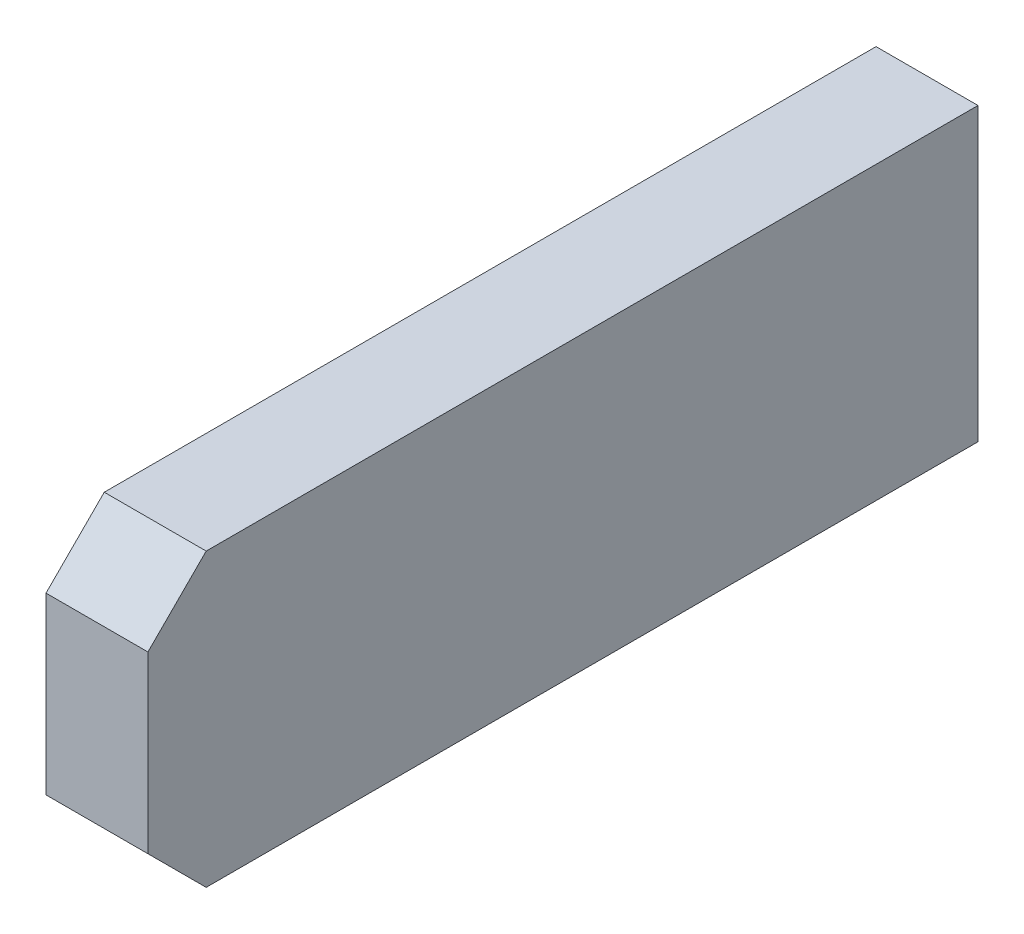
ISO-10303-21;
HEADER;
FILE_DESCRIPTION(('STEP AP214'),'2;1');
FILE_NAME('part.step','',(''),(''),'','','');
FILE_SCHEMA(('AUTOMOTIVE_DESIGN { 1 0 10303 214 1 1 1 1 }'));
ENDSEC;
DATA;
#1=APPLICATION_CONTEXT('core data for automotive mechanical design processes');
#2=APPLICATION_PROTOCOL_DEFINITION('international standard','automotive_design',2000,#1);
#3=PRODUCT_CONTEXT('',#1,'mechanical');
#4=PRODUCT('Part','Part','',(#3));
#5=PRODUCT_RELATED_PRODUCT_CATEGORY('part','',(#4));
#6=PRODUCT_DEFINITION_FORMATION('','',#4);
#7=PRODUCT_DEFINITION_CONTEXT('part definition',#1,'design');
#8=PRODUCT_DEFINITION('design','',#6,#7);
#9=PRODUCT_DEFINITION_SHAPE('','',#8);
#10=(LENGTH_UNIT() NAMED_UNIT(*) SI_UNIT(.MILLI.,.METRE.));
#11=(NAMED_UNIT(*) PLANE_ANGLE_UNIT() SI_UNIT($,.RADIAN.));
#12=(NAMED_UNIT(*) SI_UNIT($,.STERADIAN.) SOLID_ANGLE_UNIT());
#13=UNCERTAINTY_MEASURE_WITH_UNIT(LENGTH_MEASURE(1.E-05),#10,'distance_accuracy_value','');
#14=(GEOMETRIC_REPRESENTATION_CONTEXT(3) GLOBAL_UNCERTAINTY_ASSIGNED_CONTEXT((#13)) GLOBAL_UNIT_ASSIGNED_CONTEXT((#10,
#11,#12)) REPRESENTATION_CONTEXT('',''));
#15=CARTESIAN_POINT('',(0.,0.,0.));
#16=DIRECTION('',(0.,0.,1.));
#17=DIRECTION('',(1.,0.,0.));
#18=AXIS2_PLACEMENT_3D('',#15,#16,#17);
#19=CARTESIAN_POINT('',(58.82457889831,-9.921262189784,4.079481005067));
#20=DIRECTION('',(1.,0.,0.));
#21=DIRECTION('',(0.,0.,-1.));
#22=AXIS2_PLACEMENT_3D('',#19,#20,#21);
#23=PLANE('',#22);
#24=DIRECTION('',(0.,-0.707106781186548,-0.707106781186547));
#25=VECTOR('',#24,1.);
#26=CARTESIAN_POINT('',(58.82457889831,-10.72126218978,3.020000000046));
#27=LINE('',#26,#25);
#28=CARTESIAN_POINT('',(58.82457889831,-10.72126218978,3.020000000046));
#29=VERTEX_POINT('',#28);
#30=CARTESIAN_POINT('',(58.82457889831,-10.92126218978,2.820000000046));
#31=VERTEX_POINT('',#30);
#32=EDGE_CURVE('E85',#29,#31,#27,.T.);
#33=ORIENTED_EDGE('',*,*,#32,.T.);
#34=DIRECTION('',(0.,0.,-1.));
#35=VECTOR('',#34,1.);
#36=CARTESIAN_POINT('',(58.82457889831,-10.92126218978,4.079481005067));
#37=LINE('',#36,#35);
#38=CARTESIAN_POINT('',(58.82457889831,-10.92126218978,0.1700000000458));
#39=VERTEX_POINT('',#38);
#40=EDGE_CURVE('E86',#39,#31,#37,.F.);
#41=ORIENTED_EDGE('',*,*,#40,.F.);
#42=DIRECTION('',(0.,1.,0.));
#43=VECTOR('',#42,1.);
#44=CARTESIAN_POINT('',(58.82457889831,-10.92126218978,0.1700000000458));
#45=LINE('',#44,#43);
#46=CARTESIAN_POINT('',(58.82457889831,-9.921262189784,0.1700000000458));
#47=VERTEX_POINT('',#46);
#48=EDGE_CURVE('E94',#39,#47,#45,.T.);
#49=ORIENTED_EDGE('',*,*,#48,.T.);
#50=DIRECTION('',(0.,0.,1.));
#51=VECTOR('',#50,1.);
#52=CARTESIAN_POINT('',(58.82457889831,-9.921262189784,4.079481005067));
#53=LINE('',#52,#51);
#54=CARTESIAN_POINT('',(58.82457889831,-9.9212621897835,2.8200000000465));
#55=VERTEX_POINT('',#54);
#56=EDGE_CURVE('E71',#55,#47,#53,.F.);
#57=ORIENTED_EDGE('',*,*,#56,.F.);
#58=DIRECTION('',(0.,-0.707106781179474,0.707106781193621));
#59=VECTOR('',#58,1.);
#60=CARTESIAN_POINT('',(58.82457889831,-9.921262189784,2.820000000046));
#61=LINE('',#60,#59);
#62=CARTESIAN_POINT('',(58.82457889831,-10.12126218978,3.020000000046));
#63=VERTEX_POINT('',#62);
#64=EDGE_CURVE('E20',#55,#63,#61,.T.);
#65=ORIENTED_EDGE('',*,*,#64,.T.);
#66=DIRECTION('',(0.,1.,0.));
#67=VECTOR('',#66,1.);
#68=CARTESIAN_POINT('',(58.82457889831,-9.921262189784,3.020000000046));
#69=LINE('',#68,#67);
#70=EDGE_CURVE('E67',#63,#29,#69,.F.);
#71=ORIENTED_EDGE('',*,*,#70,.T.);
#72=EDGE_LOOP('',(#33,#41,#49,#57,#65,#71));
#73=FACE_BOUND('',#72,.T.);
#74=ADVANCED_FACE('F17',(#73),#23,.T.);
#75=CARTESIAN_POINT('',(58.47457889831,-10.92126218978,4.079481005067));
#76=DIRECTION('',(0.,-1.,0.));
#77=DIRECTION('',(0.,0.,-1.));
#78=AXIS2_PLACEMENT_3D('',#75,#76,#77);
#79=PLANE('',#78);
#80=DIRECTION('',(1.,0.,0.));
#81=VECTOR('',#80,1.);
#82=CARTESIAN_POINT('',(58.47457889831,-10.92126218978,2.820000000046));
#83=LINE('',#82,#81);
#84=CARTESIAN_POINT('',(58.47457889831,-10.92126218978,2.820000000046));
#85=VERTEX_POINT('',#84);
#86=EDGE_CURVE('E101',#85,#31,#83,.T.);
#87=ORIENTED_EDGE('',*,*,#86,.F.);
#88=DIRECTION('',(0.,0.,-1.));
#89=VECTOR('',#88,1.);
#90=CARTESIAN_POINT('',(58.47457889831,-10.92126218978,0.));
#91=LINE('',#90,#89);
#92=CARTESIAN_POINT('',(58.47457889831,-10.92126218978,0.1700000000458));
#93=VERTEX_POINT('',#92);
#94=EDGE_CURVE('E104',#85,#93,#91,.T.);
#95=ORIENTED_EDGE('',*,*,#94,.T.);
#96=DIRECTION('',(1.,0.,0.));
#97=VECTOR('',#96,1.);
#98=CARTESIAN_POINT('',(58.04457889831,-10.92126218978,0.1700000000458));
#99=LINE('',#98,#97);
#100=EDGE_CURVE('E91',#93,#39,#99,.T.);
#101=ORIENTED_EDGE('',*,*,#100,.T.);
#102=ORIENTED_EDGE('',*,*,#40,.T.);
#103=EDGE_LOOP('',(#87,#95,#101,#102));
#104=FACE_BOUND('',#103,.T.);
#105=ADVANCED_FACE('F121',(#104),#79,.T.);
#106=CARTESIAN_POINT('',(58.04457889831,-10.92126218978,0.1700000000458));
#107=DIRECTION('',(0.,0.,1.));
#108=DIRECTION('',(1.,0.,0.));
#109=AXIS2_PLACEMENT_3D('',#106,#107,#108);
#110=PLANE('',#109);
#111=ORIENTED_EDGE('',*,*,#100,.F.);
#112=DIRECTION('',(0.,1.,0.));
#113=VECTOR('',#112,1.);
#114=CARTESIAN_POINT('',(58.47457889831,0.,0.1700000000458));
#115=LINE('',#114,#113);
#116=CARTESIAN_POINT('',(58.47457889831,-9.921262189784,0.1700000000458));
#117=VERTEX_POINT('',#116);
#118=EDGE_CURVE('E107',#93,#117,#115,.T.);
#119=ORIENTED_EDGE('',*,*,#118,.T.);
#120=DIRECTION('',(1.,0.,0.));
#121=VECTOR('',#120,1.);
#122=CARTESIAN_POINT('',(58.47457889831,-9.921262189784,0.1700000000458));
#123=LINE('',#122,#121);
#124=EDGE_CURVE('E96',#47,#117,#123,.F.);
#125=ORIENTED_EDGE('',*,*,#124,.F.);
#126=ORIENTED_EDGE('',*,*,#48,.F.);
#127=EDGE_LOOP('',(#111,#119,#125,#126));
#128=FACE_BOUND('',#127,.T.);
#129=ADVANCED_FACE('F125',(#128),#110,.F.);
#130=CARTESIAN_POINT('',(58.47457889831,-9.921262189784,4.079481005067));
#131=DIRECTION('',(0.,1.,0.));
#132=DIRECTION('',(0.,0.,1.));
#133=AXIS2_PLACEMENT_3D('',#130,#131,#132);
#134=PLANE('',#133);
#135=DIRECTION('',(1.,0.,0.));
#136=VECTOR('',#135,1.);
#137=CARTESIAN_POINT('',(58.47457889831,-9.921262189782,2.820000000048));
#138=LINE('',#137,#136);
#139=CARTESIAN_POINT('',(58.47457889831,-9.9212621897835,2.8200000000465));
#140=VERTEX_POINT('',#139);
#141=EDGE_CURVE('E82',#55,#140,#138,.F.);
#142=ORIENTED_EDGE('',*,*,#141,.F.);
#143=ORIENTED_EDGE('',*,*,#56,.T.);
#144=ORIENTED_EDGE('',*,*,#124,.T.);
#145=DIRECTION('',(0.,0.,-1.));
#146=VECTOR('',#145,1.);
#147=CARTESIAN_POINT('',(58.47457889831,-9.921262189784,0.));
#148=LINE('',#147,#146);
#149=EDGE_CURVE('E110',#117,#140,#148,.F.);
#150=ORIENTED_EDGE('',*,*,#149,.T.);
#151=EDGE_LOOP('',(#142,#143,#144,#150));
#152=FACE_BOUND('',#151,.T.);
#153=ADVANCED_FACE('F127',(#152),#134,.T.);
#154=CARTESIAN_POINT('',(58.47457889831,-10.12126218978,3.020000000046));
#155=DIRECTION('',(0.,0.707106781186548,0.707106781186548));
#156=DIRECTION('',(0.,-0.707106781186548,0.707106781186548));
#157=AXIS2_PLACEMENT_3D('',#154,#155,#156);
#158=PLANE('',#157);
#159=ORIENTED_EDGE('',*,*,#141,.T.);
#160=DIRECTION('',(0.,-0.707106781179474,0.707106781193621));
#161=VECTOR('',#160,1.);
#162=CARTESIAN_POINT('',(58.47457889831,-9.921262189784,2.820000000046));
#163=LINE('',#162,#161);
#164=CARTESIAN_POINT('',(58.47457889831,-10.12126218978,3.020000000046));
#165=VERTEX_POINT('',#164);
#166=EDGE_CURVE('E78',#140,#165,#163,.T.);
#167=ORIENTED_EDGE('',*,*,#166,.T.);
#168=DIRECTION('',(-1.,0.,0.));
#169=VECTOR('',#168,1.);
#170=CARTESIAN_POINT('',(58.47457889831,-10.12126218978,3.020000000046));
#171=LINE('',#170,#169);
#172=EDGE_CURVE('E75',#165,#63,#171,.F.);
#173=ORIENTED_EDGE('',*,*,#172,.T.);
#174=ORIENTED_EDGE('',*,*,#64,.F.);
#175=EDGE_LOOP('',(#159,#167,#173,#174));
#176=FACE_BOUND('',#175,.T.);
#177=ADVANCED_FACE('F76',(#176),#158,.T.);
#178=CARTESIAN_POINT('',(58.47457889831,-9.871262189784,3.020000000046));
#179=DIRECTION('',(0.,0.,-1.));
#180=DIRECTION('',(-1.,0.,0.));
#181=AXIS2_PLACEMENT_3D('',#178,#179,#180);
#182=PLANE('',#181);
#183=ORIENTED_EDGE('',*,*,#70,.F.);
#184=ORIENTED_EDGE('',*,*,#172,.F.);
#185=DIRECTION('',(0.,1.,0.));
#186=VECTOR('',#185,1.);
#187=CARTESIAN_POINT('',(58.47457889831,0.,3.020000000046));
#188=LINE('',#187,#186);
#189=CARTESIAN_POINT('',(58.47457889831,-10.72126218978,3.020000000046));
#190=VERTEX_POINT('',#189);
#191=EDGE_CURVE('E26',#165,#190,#188,.F.);
#192=ORIENTED_EDGE('',*,*,#191,.T.);
#193=DIRECTION('',(1.,0.,0.));
#194=VECTOR('',#193,1.);
#195=CARTESIAN_POINT('',(58.47457889831,-10.72126218978,3.020000000046));
#196=LINE('',#195,#194);
#197=EDGE_CURVE('E34',#29,#190,#196,.F.);
#198=ORIENTED_EDGE('',*,*,#197,.F.);
#199=EDGE_LOOP('',(#183,#184,#192,#198));
#200=FACE_BOUND('',#199,.T.);
#201=ADVANCED_FACE('F84',(#200),#182,.F.);
#202=CARTESIAN_POINT('',(58.47457889831,-10.72126218978,3.020000000046));
#203=DIRECTION('',(0.,-0.707106781186548,0.707106781186548));
#204=DIRECTION('',(0.,-0.707106781186548,-0.707106781186548));
#205=AXIS2_PLACEMENT_3D('',#202,#203,#204);
#206=PLANE('',#205);
#207=ORIENTED_EDGE('',*,*,#86,.T.);
#208=ORIENTED_EDGE('',*,*,#32,.F.);
#209=ORIENTED_EDGE('',*,*,#197,.T.);
#210=DIRECTION('',(0.,-0.707106781186548,-0.707106781186547));
#211=VECTOR('',#210,1.);
#212=CARTESIAN_POINT('',(58.47457889831,-10.72126218978,3.020000000046));
#213=LINE('',#212,#211);
#214=EDGE_CURVE('E11',#190,#85,#213,.T.);
#215=ORIENTED_EDGE('',*,*,#214,.T.);
#216=EDGE_LOOP('',(#207,#208,#209,#215));
#217=FACE_BOUND('',#216,.T.);
#218=ADVANCED_FACE('F119',(#217),#206,.T.);
#219=CARTESIAN_POINT('',(58.47457889831,0.,0.));
#220=DIRECTION('',(1.,0.,0.));
#221=DIRECTION('',(0.,0.,-1.));
#222=AXIS2_PLACEMENT_3D('',#219,#220,#221);
#223=PLANE('',#222);
#224=ORIENTED_EDGE('',*,*,#191,.F.);
#225=ORIENTED_EDGE('',*,*,#166,.F.);
#226=ORIENTED_EDGE('',*,*,#149,.F.);
#227=ORIENTED_EDGE('',*,*,#118,.F.);
#228=ORIENTED_EDGE('',*,*,#94,.F.);
#229=ORIENTED_EDGE('',*,*,#214,.F.);
#230=EDGE_LOOP('',(#224,#225,#226,#227,#228,#229));
#231=FACE_BOUND('',#230,.T.);
#232=ADVANCED_FACE('F115',(#231),#223,.F.);
#233=CLOSED_SHELL('',(#74,#105,#129,#153,#177,#201,#218,#232));
#234=MANIFOLD_SOLID_BREP('B1',#233);
#235=ADVANCED_BREP_SHAPE_REPRESENTATION('',(#18,#234),#14);
#236=SHAPE_DEFINITION_REPRESENTATION(#9,#235);
ENDSEC;
END-ISO-10303-21;
